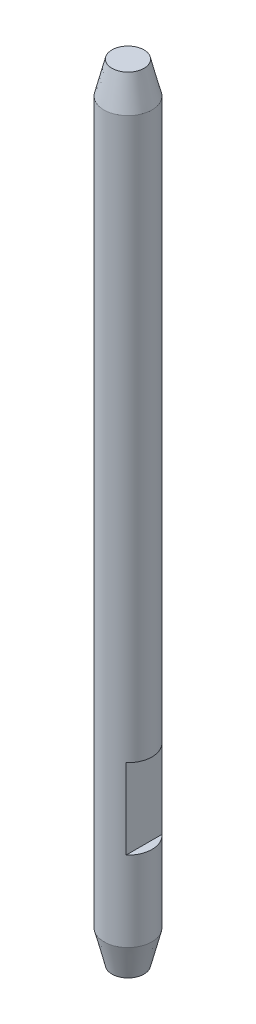
ISO-10303-21;
HEADER;
FILE_DESCRIPTION(('STEP AP214'),'2;1');
FILE_NAME('part.step','',(''),(''),'','','');
FILE_SCHEMA(('AUTOMOTIVE_DESIGN { 1 0 10303 214 1 1 1 1 }'));
ENDSEC;
DATA;
#1=APPLICATION_CONTEXT('core data for automotive mechanical design processes');
#2=APPLICATION_PROTOCOL_DEFINITION('international standard','automotive_design',2000,#1);
#3=PRODUCT_CONTEXT('',#1,'mechanical');
#4=PRODUCT('Part','Part','',(#3));
#5=PRODUCT_RELATED_PRODUCT_CATEGORY('part','',(#4));
#6=PRODUCT_DEFINITION_FORMATION('','',#4);
#7=PRODUCT_DEFINITION_CONTEXT('part definition',#1,'design');
#8=PRODUCT_DEFINITION('design','',#6,#7);
#9=PRODUCT_DEFINITION_SHAPE('','',#8);
#10=(LENGTH_UNIT() NAMED_UNIT(*) SI_UNIT(.MILLI.,.METRE.));
#11=(NAMED_UNIT(*) PLANE_ANGLE_UNIT() SI_UNIT($,.RADIAN.));
#12=(NAMED_UNIT(*) SI_UNIT($,.STERADIAN.) SOLID_ANGLE_UNIT());
#13=UNCERTAINTY_MEASURE_WITH_UNIT(LENGTH_MEASURE(1.E-05),#10,'distance_accuracy_value','');
#14=(GEOMETRIC_REPRESENTATION_CONTEXT(3) GLOBAL_UNCERTAINTY_ASSIGNED_CONTEXT((#13)) GLOBAL_UNIT_ASSIGNED_CONTEXT((#10,
#11,#12)) REPRESENTATION_CONTEXT('',''));
#15=CARTESIAN_POINT('',(0.,0.,0.));
#16=DIRECTION('',(0.,0.,1.));
#17=DIRECTION('',(1.,0.,0.));
#18=AXIS2_PLACEMENT_3D('',#15,#16,#17);
#19=CARTESIAN_POINT('',(0.,49.,0.));
#20=DIRECTION('',(0.,-1.,0.));
#21=DIRECTION('',(0.,0.,-1.));
#22=AXIS2_PLACEMENT_3D('',#19,#20,#21);
#23=CYLINDRICAL_SURFACE('',#22,1.5);
#24=DIRECTION('',(0.,-1.,0.));
#25=VECTOR('',#24,1.);
#26=CARTESIAN_POINT('',(1.,49.,-1.11803398874989));
#27=LINE('',#26,#25);
#28=CARTESIAN_POINT('',(1.,7.,-1.11803398874989));
#29=VERTEX_POINT('',#28);
#30=CARTESIAN_POINT('',(1.,12.,-1.11803398874989));
#31=VERTEX_POINT('',#30);
#32=EDGE_CURVE('E43',#29,#31,#27,.F.);
#33=ORIENTED_EDGE('',*,*,#32,.F.);
#34=CARTESIAN_POINT('',(0.,7.,0.));
#35=DIRECTION('',(0.,-1.,0.));
#36=DIRECTION('',(0.,0.,-1.));
#37=AXIS2_PLACEMENT_3D('',#34,#35,#36);
#38=CIRCLE('',#37,1.5);
#39=CARTESIAN_POINT('',(1.,7.,1.11803398874989));
#40=VERTEX_POINT('',#39);
#41=EDGE_CURVE('E49',#29,#40,#38,.T.);
#42=ORIENTED_EDGE('',*,*,#41,.T.);
#43=DIRECTION('',(0.,-1.,0.));
#44=VECTOR('',#43,1.);
#45=CARTESIAN_POINT('',(1.,49.,1.11803398874989));
#46=LINE('',#45,#44);
#47=CARTESIAN_POINT('',(1.,12.,1.11803398874989));
#48=VERTEX_POINT('',#47);
#49=EDGE_CURVE('E11',#48,#40,#46,.T.);
#50=ORIENTED_EDGE('',*,*,#49,.F.);
#51=CARTESIAN_POINT('',(0.,12.,0.));
#52=DIRECTION('',(0.,1.,0.));
#53=DIRECTION('',(0.,0.,1.));
#54=AXIS2_PLACEMENT_3D('',#51,#52,#53);
#55=CIRCLE('',#54,1.5);
#56=EDGE_CURVE('E56',#48,#31,#55,.T.);
#57=ORIENTED_EDGE('',*,*,#56,.T.);
#58=EDGE_LOOP('',(#33,#42,#50,#57));
#59=FACE_BOUND('',#58,.T.);
#60=CARTESIAN_POINT('',(0.,47.,0.));
#61=DIRECTION('',(0.,1.,0.));
#62=DIRECTION('',(0.,0.,1.));
#63=AXIS2_PLACEMENT_3D('',#60,#61,#62);
#64=CIRCLE('',#63,1.5);
#65=CARTESIAN_POINT('',(0.,47.,1.5));
#66=VERTEX_POINT('',#65);
#67=EDGE_CURVE('E74',#66,#66,#64,.F.);
#68=ORIENTED_EDGE('',*,*,#67,.T.);
#69=EDGE_LOOP('',(#68));
#70=FACE_BOUND('',#69,.T.);
#71=CARTESIAN_POINT('',(0.,2.00000000000006,0.));
#72=DIRECTION('',(0.,1.,0.));
#73=DIRECTION('',(0.,0.,1.));
#74=AXIS2_PLACEMENT_3D('',#71,#72,#73);
#75=CIRCLE('',#74,1.5);
#76=CARTESIAN_POINT('',(0.,2.00000000000006,1.5));
#77=VERTEX_POINT('',#76);
#78=EDGE_CURVE('E70',#77,#77,#75,.T.);
#79=ORIENTED_EDGE('',*,*,#78,.T.);
#80=EDGE_LOOP('',(#79));
#81=FACE_BOUND('',#80,.T.);
#82=ADVANCED_FACE('F35',(#59,#70,#81),#23,.T.);
#83=CARTESIAN_POINT('',(0.,49.,0.));
#84=DIRECTION('',(0.,1.,0.));
#85=DIRECTION('',(0.,0.,1.));
#86=AXIS2_PLACEMENT_3D('',#83,#84,#85);
#87=PLANE('',#86);
#88=CARTESIAN_POINT('',(0.,49.,0.));
#89=DIRECTION('',(0.,1.,0.));
#90=DIRECTION('',(0.,0.,1.));
#91=AXIS2_PLACEMENT_3D('',#88,#89,#90);
#92=CIRCLE('',#91,1.00000000000001);
#93=CARTESIAN_POINT('',(0.,49.,1.00000000000001));
#94=VERTEX_POINT('',#93);
#95=EDGE_CURVE('E79',#94,#94,#92,.T.);
#96=ORIENTED_EDGE('',*,*,#95,.T.);
#97=EDGE_LOOP('',(#96));
#98=FACE_BOUND('',#97,.T.);
#99=ADVANCED_FACE('F99',(#98),#87,.T.);
#100=CARTESIAN_POINT('',(0.,0.,0.));
#101=DIRECTION('',(0.,1.,0.));
#102=DIRECTION('',(0.,0.,1.));
#103=AXIS2_PLACEMENT_3D('',#100,#101,#102);
#104=PLANE('',#103);
#105=CARTESIAN_POINT('',(0.,0.,0.));
#106=DIRECTION('',(0.,1.,0.));
#107=DIRECTION('',(0.,0.,1.));
#108=AXIS2_PLACEMENT_3D('',#105,#106,#107);
#109=CIRCLE('',#108,0.999999999999992);
#110=CARTESIAN_POINT('',(0.,0.,0.999999999999992));
#111=VERTEX_POINT('',#110);
#112=EDGE_CURVE('E82',#111,#111,#109,.F.);
#113=ORIENTED_EDGE('',*,*,#112,.T.);
#114=EDGE_LOOP('',(#113));
#115=FACE_BOUND('',#114,.T.);
#116=ADVANCED_FACE('F92',(#115),#104,.F.);
#117=CARTESIAN_POINT('',(0.,2.00000000000006,0.));
#118=DIRECTION('',(0.,1.,0.));
#119=DIRECTION('',(0.,0.,1.));
#120=AXIS2_PLACEMENT_3D('',#117,#118,#119);
#121=CONICAL_SURFACE('',#120,1.5,0.244978663126861);
#122=ORIENTED_EDGE('',*,*,#112,.F.);
#123=EDGE_LOOP('',(#122));
#124=FACE_BOUND('',#123,.T.);
#125=ORIENTED_EDGE('',*,*,#78,.F.);
#126=EDGE_LOOP('',(#125));
#127=FACE_BOUND('',#126,.T.);
#128=ADVANCED_FACE('F90',(#124,#127),#121,.T.);
#129=CARTESIAN_POINT('',(0.,49.,0.));
#130=DIRECTION('',(0.,-1.,0.));
#131=DIRECTION('',(0.,0.,-1.));
#132=AXIS2_PLACEMENT_3D('',#129,#130,#131);
#133=CONICAL_SURFACE('',#132,1.00000000000001,0.24497866312686);
#134=ORIENTED_EDGE('',*,*,#67,.F.);
#135=EDGE_LOOP('',(#134));
#136=FACE_BOUND('',#135,.T.);
#137=ORIENTED_EDGE('',*,*,#95,.F.);
#138=EDGE_LOOP('',(#137));
#139=FACE_BOUND('',#138,.T.);
#140=ADVANCED_FACE('F37',(#136,#139),#133,.T.);
#141=CARTESIAN_POINT('',(1.,7.,3.));
#142=DIRECTION('',(0.,-1.,0.));
#143=DIRECTION('',(0.,0.,-1.));
#144=AXIS2_PLACEMENT_3D('',#141,#142,#143);
#145=PLANE('',#144);
#146=DIRECTION('',(0.,0.,-1.));
#147=VECTOR('',#146,1.);
#148=CARTESIAN_POINT('',(1.,7.,3.));
#149=LINE('',#148,#147);
#150=EDGE_CURVE('E65',#40,#29,#149,.T.);
#151=ORIENTED_EDGE('',*,*,#150,.F.);
#152=ORIENTED_EDGE('',*,*,#41,.F.);
#153=EDGE_LOOP('',(#151,#152));
#154=FACE_BOUND('',#153,.T.);
#155=ADVANCED_FACE('F69',(#154),#145,.F.);
#156=CARTESIAN_POINT('',(1.,12.,3.));
#157=DIRECTION('',(0.,1.,0.));
#158=DIRECTION('',(0.,0.,1.));
#159=AXIS2_PLACEMENT_3D('',#156,#157,#158);
#160=PLANE('',#159);
#161=DIRECTION('',(0.,0.,1.));
#162=VECTOR('',#161,1.);
#163=CARTESIAN_POINT('',(1.,12.,3.));
#164=LINE('',#163,#162);
#165=EDGE_CURVE('E67',#31,#48,#164,.T.);
#166=ORIENTED_EDGE('',*,*,#165,.F.);
#167=ORIENTED_EDGE('',*,*,#56,.F.);
#168=EDGE_LOOP('',(#166,#167));
#169=FACE_BOUND('',#168,.T.);
#170=ADVANCED_FACE('F111',(#169),#160,.F.);
#171=CARTESIAN_POINT('',(1.,0.,0.));
#172=DIRECTION('',(1.,0.,0.));
#173=DIRECTION('',(0.,0.,-1.));
#174=AXIS2_PLACEMENT_3D('',#171,#172,#173);
#175=PLANE('',#174);
#176=ORIENTED_EDGE('',*,*,#49,.T.);
#177=ORIENTED_EDGE('',*,*,#150,.T.);
#178=ORIENTED_EDGE('',*,*,#32,.T.);
#179=ORIENTED_EDGE('',*,*,#165,.T.);
#180=EDGE_LOOP('',(#176,#177,#178,#179));
#181=FACE_BOUND('',#180,.T.);
#182=ADVANCED_FACE('F64',(#181),#175,.T.);
#183=CLOSED_SHELL('',(#82,#99,#116,#128,#140,#155,#170,#182));
#184=MANIFOLD_SOLID_BREP('B2',#183);
#185=ADVANCED_BREP_SHAPE_REPRESENTATION('',(#18,#184),#14);
#186=SHAPE_DEFINITION_REPRESENTATION(#9,#185);
ENDSEC;
END-ISO-10303-21;
